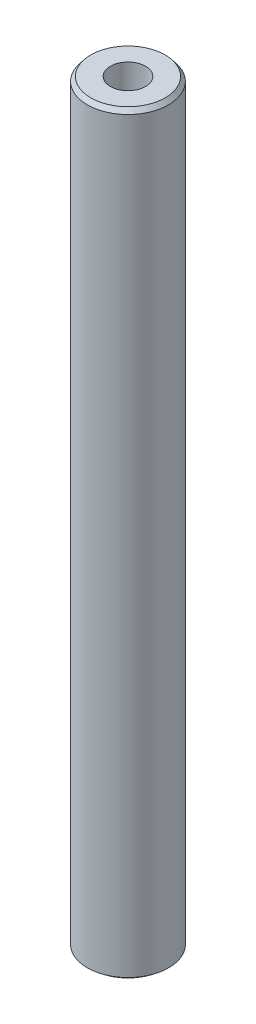
ISO-10303-21;
HEADER;
FILE_DESCRIPTION(('STEP AP214'),'2;1');
FILE_NAME('part.step','',(''),(''),'','','');
FILE_SCHEMA(('AUTOMOTIVE_DESIGN { 1 0 10303 214 1 1 1 1 }'));
ENDSEC;
DATA;
#1=APPLICATION_CONTEXT('core data for automotive mechanical design processes');
#2=APPLICATION_PROTOCOL_DEFINITION('international standard','automotive_design',2000,#1);
#3=PRODUCT_CONTEXT('',#1,'mechanical');
#4=PRODUCT('Part','Part','',(#3));
#5=PRODUCT_RELATED_PRODUCT_CATEGORY('part','',(#4));
#6=PRODUCT_DEFINITION_FORMATION('','',#4);
#7=PRODUCT_DEFINITION_CONTEXT('part definition',#1,'design');
#8=PRODUCT_DEFINITION('design','',#6,#7);
#9=PRODUCT_DEFINITION_SHAPE('','',#8);
#10=(LENGTH_UNIT() NAMED_UNIT(*) SI_UNIT(.MILLI.,.METRE.));
#11=(NAMED_UNIT(*) PLANE_ANGLE_UNIT() SI_UNIT($,.RADIAN.));
#12=(NAMED_UNIT(*) SI_UNIT($,.STERADIAN.) SOLID_ANGLE_UNIT());
#13=UNCERTAINTY_MEASURE_WITH_UNIT(LENGTH_MEASURE(1.E-05),#10,'distance_accuracy_value','');
#14=(GEOMETRIC_REPRESENTATION_CONTEXT(3) GLOBAL_UNCERTAINTY_ASSIGNED_CONTEXT((#13)) GLOBAL_UNIT_ASSIGNED_CONTEXT((#10,
#11,#12)) REPRESENTATION_CONTEXT('',''));
#15=CARTESIAN_POINT('',(0.,0.,0.));
#16=DIRECTION('',(0.,0.,1.));
#17=DIRECTION('',(1.,0.,0.));
#18=AXIS2_PLACEMENT_3D('',#15,#16,#17);
#19=CARTESIAN_POINT('',(0.,464.604287946502,0.));
#20=DIRECTION('',(0.,-1.,0.));
#21=DIRECTION('',(0.,0.,-1.));
#22=AXIS2_PLACEMENT_3D('',#19,#20,#21);
#23=CYLINDRICAL_SURFACE('',#22,25.);
#24=CARTESIAN_POINT('',(0.,461.932527163977,0.));
#25=DIRECTION('',(0.,1.,0.));
#26=DIRECTION('',(0.,0.,1.));
#27=AXIS2_PLACEMENT_3D('',#24,#25,#26);
#28=CIRCLE('',#27,25.);
#29=CARTESIAN_POINT('',(0.,461.932527163977,25.));
#30=VERTEX_POINT('',#29);
#31=EDGE_CURVE('E50',#30,#30,#28,.F.);
#32=ORIENTED_EDGE('',*,*,#31,.T.);
#33=EDGE_LOOP('',(#32));
#34=FACE_BOUND('',#33,.T.);
#35=CARTESIAN_POINT('',(0.,2.11485986801885,0.));
#36=DIRECTION('',(0.,1.,0.));
#37=DIRECTION('',(0.,0.,1.));
#38=AXIS2_PLACEMENT_3D('',#35,#36,#37);
#39=CIRCLE('',#38,25.);
#40=CARTESIAN_POINT('',(0.,2.11485986801885,25.));
#41=VERTEX_POINT('',#40);
#42=EDGE_CURVE('E51',#41,#41,#39,.T.);
#43=ORIENTED_EDGE('',*,*,#42,.T.);
#44=EDGE_LOOP('',(#43));
#45=FACE_BOUND('',#44,.T.);
#46=ADVANCED_FACE('F39',(#34,#45),#23,.T.);
#47=CARTESIAN_POINT('',(0.,464.604287946502,0.));
#48=DIRECTION('',(0.,1.,0.));
#49=DIRECTION('',(0.,0.,1.));
#50=AXIS2_PLACEMENT_3D('',#47,#48,#49);
#51=PLANE('',#50);
#52=CARTESIAN_POINT('',(0.,464.604287946502,0.));
#53=DIRECTION('',(0.,1.,0.));
#54=DIRECTION('',(0.,0.,1.));
#55=AXIS2_PLACEMENT_3D('',#52,#53,#54);
#56=CIRCLE('',#55,22.8851401319811);
#57=CARTESIAN_POINT('',(0.,464.604287946502,22.8851401319811));
#58=VERTEX_POINT('',#57);
#59=EDGE_CURVE('E54',#58,#58,#56,.T.);
#60=ORIENTED_EDGE('',*,*,#59,.T.);
#61=EDGE_LOOP('',(#60));
#62=FACE_BOUND('',#61,.T.);
#63=CARTESIAN_POINT('',(0.,464.604287946502,0.));
#64=DIRECTION('',(0.,1.,0.));
#65=DIRECTION('',(0.,0.,1.));
#66=AXIS2_PLACEMENT_3D('',#63,#64,#65);
#67=CIRCLE('',#66,10.8217885533453);
#68=CARTESIAN_POINT('',(0.,464.604287946502,10.8217885533453));
#69=VERTEX_POINT('',#68);
#70=EDGE_CURVE('E58',#69,#69,#67,.T.);
#71=ORIENTED_EDGE('',*,*,#70,.F.);
#72=EDGE_LOOP('',(#71));
#73=FACE_BOUND('',#72,.T.);
#74=ADVANCED_FACE('F69',(#62,#73),#51,.T.);
#75=CARTESIAN_POINT('',(0.,0.,0.));
#76=DIRECTION('',(0.,1.,0.));
#77=DIRECTION('',(0.,0.,1.));
#78=AXIS2_PLACEMENT_3D('',#75,#76,#77);
#79=PLANE('',#78);
#80=CARTESIAN_POINT('',(0.,0.,0.));
#81=DIRECTION('',(0.,1.,0.));
#82=DIRECTION('',(0.,0.,1.));
#83=AXIS2_PLACEMENT_3D('',#80,#81,#82);
#84=CIRCLE('',#83,22.3282392174757);
#85=CARTESIAN_POINT('',(0.,0.,22.3282392174757));
#86=VERTEX_POINT('',#85);
#87=EDGE_CURVE('E10',#86,#86,#84,.F.);
#88=ORIENTED_EDGE('',*,*,#87,.T.);
#89=EDGE_LOOP('',(#88));
#90=FACE_BOUND('',#89,.T.);
#91=CARTESIAN_POINT('',(0.,0.,0.));
#92=DIRECTION('',(0.,1.,0.));
#93=DIRECTION('',(0.,0.,1.));
#94=AXIS2_PLACEMENT_3D('',#91,#92,#93);
#95=CIRCLE('',#94,10.8217885533453);
#96=CARTESIAN_POINT('',(0.,0.,10.8217885533453));
#97=VERTEX_POINT('',#96);
#98=EDGE_CURVE('E63',#97,#97,#95,.T.);
#99=ORIENTED_EDGE('',*,*,#98,.T.);
#100=EDGE_LOOP('',(#99));
#101=FACE_BOUND('',#100,.T.);
#102=ADVANCED_FACE('F75',(#90,#101),#79,.F.);
#103=CARTESIAN_POINT('',(0.,464.604287946502,0.));
#104=DIRECTION('',(0.,-1.,0.));
#105=DIRECTION('',(0.,0.,-1.));
#106=AXIS2_PLACEMENT_3D('',#103,#104,#105);
#107=CYLINDRICAL_SURFACE('',#106,10.8217885533453);
#108=ORIENTED_EDGE('',*,*,#70,.T.);
#109=EDGE_LOOP('',(#108));
#110=FACE_BOUND('',#109,.T.);
#111=ORIENTED_EDGE('',*,*,#98,.F.);
#112=EDGE_LOOP('',(#111));
#113=FACE_BOUND('',#112,.T.);
#114=ADVANCED_FACE('F70',(#110,#113),#107,.F.);
#115=CARTESIAN_POINT('',(0.,464.604287946502,0.));
#116=DIRECTION('',(0.,-1.,0.));
#117=DIRECTION('',(0.,0.,-1.));
#118=AXIS2_PLACEMENT_3D('',#115,#116,#117);
#119=CONICAL_SURFACE('',#118,22.8851401319811,0.669573579089315);
#120=ORIENTED_EDGE('',*,*,#31,.F.);
#121=EDGE_LOOP('',(#120));
#122=FACE_BOUND('',#121,.T.);
#123=ORIENTED_EDGE('',*,*,#59,.F.);
#124=EDGE_LOOP('',(#123));
#125=FACE_BOUND('',#124,.T.);
#126=ADVANCED_FACE('F81',(#122,#125),#119,.T.);
#127=CARTESIAN_POINT('',(0.,2.11485986801885,0.));
#128=DIRECTION('',(0.,1.,0.));
#129=DIRECTION('',(0.,0.,1.));
#130=AXIS2_PLACEMENT_3D('',#127,#128,#129);
#131=CONICAL_SURFACE('',#130,25.,0.901222747705569);
#132=ORIENTED_EDGE('',*,*,#87,.F.);
#133=EDGE_LOOP('',(#132));
#134=FACE_BOUND('',#133,.T.);
#135=ORIENTED_EDGE('',*,*,#42,.F.);
#136=EDGE_LOOP('',(#135));
#137=FACE_BOUND('',#136,.T.);
#138=ADVANCED_FACE('F45',(#134,#137),#131,.T.);
#139=CLOSED_SHELL('',(#46,#74,#102,#114,#126,#138));
#140=MANIFOLD_SOLID_BREP('B2',#139);
#141=ADVANCED_BREP_SHAPE_REPRESENTATION('',(#18,#140),#14);
#142=SHAPE_DEFINITION_REPRESENTATION(#9,#141);
ENDSEC;
END-ISO-10303-21;
